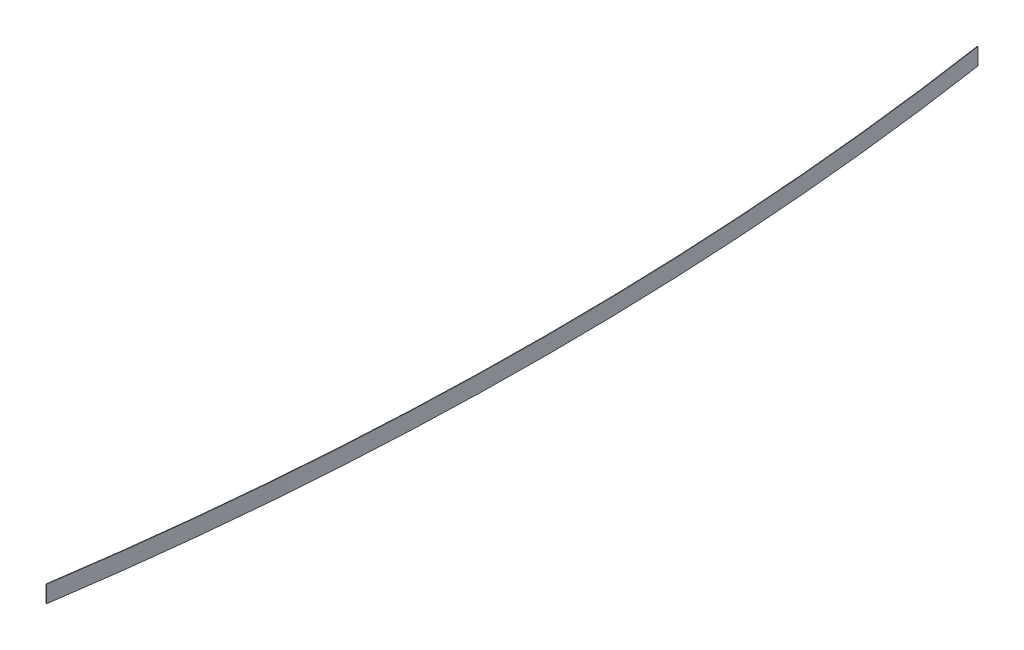
ISO-10303-21;
HEADER;
FILE_DESCRIPTION(('STEP AP214'),'2;1');
FILE_NAME('part.step','',(''),(''),'','','');
FILE_SCHEMA(('AUTOMOTIVE_DESIGN { 1 0 10303 214 1 1 1 1 }'));
ENDSEC;
DATA;
#1=APPLICATION_CONTEXT('core data for automotive mechanical design processes');
#2=APPLICATION_PROTOCOL_DEFINITION('international standard','automotive_design',2000,#1);
#3=PRODUCT_CONTEXT('',#1,'mechanical');
#4=PRODUCT('Part','Part','',(#3));
#5=PRODUCT_RELATED_PRODUCT_CATEGORY('part','',(#4));
#6=PRODUCT_DEFINITION_FORMATION('','',#4);
#7=PRODUCT_DEFINITION_CONTEXT('part definition',#1,'design');
#8=PRODUCT_DEFINITION('design','',#6,#7);
#9=PRODUCT_DEFINITION_SHAPE('','',#8);
#10=(LENGTH_UNIT() NAMED_UNIT(*) SI_UNIT(.MILLI.,.METRE.));
#11=(NAMED_UNIT(*) PLANE_ANGLE_UNIT() SI_UNIT($,.RADIAN.));
#12=(NAMED_UNIT(*) SI_UNIT($,.STERADIAN.) SOLID_ANGLE_UNIT());
#13=UNCERTAINTY_MEASURE_WITH_UNIT(LENGTH_MEASURE(1.E-05),#10,'distance_accuracy_value','');
#14=(GEOMETRIC_REPRESENTATION_CONTEXT(3) GLOBAL_UNCERTAINTY_ASSIGNED_CONTEXT((#13)) GLOBAL_UNIT_ASSIGNED_CONTEXT((#10,
#11,#12)) REPRESENTATION_CONTEXT('',''));
#15=CARTESIAN_POINT('',(0.,0.,0.));
#16=DIRECTION('',(0.,0.,1.));
#17=DIRECTION('',(1.,0.,0.));
#18=AXIS2_PLACEMENT_3D('',#15,#16,#17);
#19=CARTESIAN_POINT('',(-3.55271367880053E-12,56.9999999994,1.33226762955018E-12));
#20=DIRECTION('',(0.,1.,0.));
#21=DIRECTION('',(-1.,0.,0.));
#22=AXIS2_PLACEMENT_3D('',#19,#20,#21);
#23=PLANE('',#22);
#24=DIRECTION('',(0.988912431917555,0.,-0.148499838380073));
#25=VECTOR('',#24,1.);
#26=CARTESIAN_POINT('',(20830.9459221273,57.0000000000004,-3128.07484555705));
#27=LINE('',#26,#25);
#28=CARTESIAN_POINT('',(20829.4625534795,57.0000000000004,-3127.85209579947));
#29=VERTEX_POINT('',#28);
#30=CARTESIAN_POINT('',(20832.4292907752,57.0000000000005,-3128.29759531461));
#31=VERTEX_POINT('',#30);
#32=EDGE_CURVE('E11',#29,#31,#27,.T.);
#33=ORIENTED_EDGE('',*,*,#32,.F.);
#34=CARTESIAN_POINT('',(-3.55271367880053E-12,56.9999999994,1.33226762955018E-12));
#35=DIRECTION('',(0.,1.,0.));
#36=DIRECTION('',(-1.,0.,0.));
#37=AXIS2_PLACEMENT_3D('',#34,#35,#36);
#38=CIRCLE('',#37,21063.);
#39=CARTESIAN_POINT('',(20829.4625534795,57.000000000097,3127.85209579947));
#40=VERTEX_POINT('',#39);
#41=EDGE_CURVE('E103',#29,#40,#38,.F.);
#42=ORIENTED_EDGE('',*,*,#41,.T.);
#43=DIRECTION('',(0.988912431917555,0.,0.148499838380073));
#44=VECTOR('',#43,1.);
#45=CARTESIAN_POINT('',(20830.9459221273,57.0000000000976,3128.07484555704));
#46=LINE('',#45,#44);
#47=CARTESIAN_POINT('',(20832.4292907752,57.0000000000971,3128.29759531461));
#48=VERTEX_POINT('',#47);
#49=EDGE_CURVE('E51',#40,#48,#46,.T.);
#50=ORIENTED_EDGE('',*,*,#49,.T.);
#51=CARTESIAN_POINT('',(-3.55271367880053E-12,56.9999999994,1.33226762955018E-12));
#52=DIRECTION('',(0.,1.,0.));
#53=DIRECTION('',(-1.,0.,0.));
#54=AXIS2_PLACEMENT_3D('',#51,#52,#53);
#55=CIRCLE('',#54,21066.);
#56=EDGE_CURVE('E97',#31,#48,#55,.F.);
#57=ORIENTED_EDGE('',*,*,#56,.F.);
#58=EDGE_LOOP('',(#33,#42,#50,#57));
#59=FACE_BOUND('',#58,.T.);
#60=ADVANCED_FACE('F41',(#59),#23,.T.);
#61=CARTESIAN_POINT('',(20830.9459221273,9.73388036840106E-11,3128.07484555704));
#62=DIRECTION('',(-0.148499838380073,0.,0.988912431917555));
#63=DIRECTION('',(0.,-1.,0.));
#64=AXIS2_PLACEMENT_3D('',#61,#62,#63);
#65=PLANE('',#64);
#66=ORIENTED_EDGE('',*,*,#49,.F.);
#67=DIRECTION('',(0.,1.,0.));
#68=VECTOR('',#67,1.);
#69=CARTESIAN_POINT('',(20829.4625534797,-6338.29091595613,3127.85209579957));
#70=LINE('',#69,#68);
#71=CARTESIAN_POINT('',(20829.4625534795,-56.9999999999029,3127.85209579947));
#72=VERTEX_POINT('',#71);
#73=EDGE_CURVE('E85',#40,#72,#70,.F.);
#74=ORIENTED_EDGE('',*,*,#73,.T.);
#75=DIRECTION('',(0.988912431917555,0.,0.148499838380073));
#76=VECTOR('',#75,1.);
#77=CARTESIAN_POINT('',(20830.9459221273,-56.9999999999029,3128.07484555704));
#78=LINE('',#77,#76);
#79=CARTESIAN_POINT('',(20832.4292907752,-56.9999999999028,3128.29759531462));
#80=VERTEX_POINT('',#79);
#81=EDGE_CURVE('E80',#72,#80,#78,.T.);
#82=ORIENTED_EDGE('',*,*,#81,.T.);
#83=DIRECTION('',(0.,1.,0.));
#84=VECTOR('',#83,1.);
#85=CARTESIAN_POINT('',(20832.4292907754,-6338.29091595613,3128.29759531471));
#86=LINE('',#85,#84);
#87=EDGE_CURVE('E83',#48,#80,#86,.F.);
#88=ORIENTED_EDGE('',*,*,#87,.F.);
#89=EDGE_LOOP('',(#66,#74,#82,#88));
#90=FACE_BOUND('',#89,.T.);
#91=ADVANCED_FACE('F82',(#90),#65,.T.);
#92=CARTESIAN_POINT('',(0.,-57.0000000006008,3.10862446895043E-12));
#93=DIRECTION('',(0.,-1.,0.));
#94=DIRECTION('',(1.,0.,0.));
#95=AXIS2_PLACEMENT_3D('',#92,#93,#94);
#96=PLANE('',#95);
#97=ORIENTED_EDGE('',*,*,#81,.F.);
#98=CARTESIAN_POINT('',(0.,-57.0000000006008,3.10862446895043E-12));
#99=DIRECTION('',(0.,1.,0.));
#100=DIRECTION('',(-1.,0.,0.));
#101=AXIS2_PLACEMENT_3D('',#98,#99,#100);
#102=CIRCLE('',#101,21063.);
#103=CARTESIAN_POINT('',(20829.4625534795,-57.0000000000004,-3127.85209579944));
#104=VERTEX_POINT('',#103);
#105=EDGE_CURVE('E109',#72,#104,#102,.T.);
#106=ORIENTED_EDGE('',*,*,#105,.T.);
#107=DIRECTION('',(0.988912431917555,0.,-0.148499838380072));
#108=VECTOR('',#107,1.);
#109=CARTESIAN_POINT('',(20830.9459221273,-57.0000000000004,-3128.07484555702));
#110=LINE('',#109,#108);
#111=CARTESIAN_POINT('',(20832.4292907752,-57.0000000000003,-3128.29759531459));
#112=VERTEX_POINT('',#111);
#113=EDGE_CURVE('E45',#104,#112,#110,.T.);
#114=ORIENTED_EDGE('',*,*,#113,.T.);
#115=CARTESIAN_POINT('',(0.,-57.0000000006008,3.10862446895043E-12));
#116=DIRECTION('',(0.,1.,0.));
#117=DIRECTION('',(-1.,0.,0.));
#118=AXIS2_PLACEMENT_3D('',#115,#116,#117);
#119=CIRCLE('',#118,21066.);
#120=EDGE_CURVE('E96',#80,#112,#119,.T.);
#121=ORIENTED_EDGE('',*,*,#120,.F.);
#122=EDGE_LOOP('',(#97,#106,#114,#121));
#123=FACE_BOUND('',#122,.T.);
#124=ADVANCED_FACE('F99',(#123),#96,.T.);
#125=CARTESIAN_POINT('',(20830.9459221273,0.,-3128.07484555704));
#126=DIRECTION('',(-0.148499838380073,0.,-0.988912431917555));
#127=DIRECTION('',(0.,1.,0.));
#128=AXIS2_PLACEMENT_3D('',#125,#126,#127);
#129=PLANE('',#128);
#130=DIRECTION('',(0.,1.,0.));
#131=VECTOR('',#130,1.);
#132=CARTESIAN_POINT('',(20829.4625534797,-6338.29091595623,-3127.85209579937));
#133=LINE('',#132,#131);
#134=EDGE_CURVE('E101',#104,#29,#133,.T.);
#135=ORIENTED_EDGE('',*,*,#134,.T.);
#136=ORIENTED_EDGE('',*,*,#32,.T.);
#137=DIRECTION('',(0.,1.,0.));
#138=VECTOR('',#137,1.);
#139=CARTESIAN_POINT('',(20832.4292907754,-6338.29091595623,-3128.29759531451));
#140=LINE('',#139,#138);
#141=EDGE_CURVE('E107',#112,#31,#140,.T.);
#142=ORIENTED_EDGE('',*,*,#141,.F.);
#143=ORIENTED_EDGE('',*,*,#113,.F.);
#144=EDGE_LOOP('',(#135,#136,#142,#143));
#145=FACE_BOUND('',#144,.T.);
#146=ADVANCED_FACE('F43',(#145),#129,.T.);
#147=CARTESIAN_POINT('',(1.95751124189851E-10,-6338.29091595683,1.00984186563876E-10));
#148=DIRECTION('',(0.,1.,0.));
#149=DIRECTION('',(-1.,0.,0.));
#150=AXIS2_PLACEMENT_3D('',#147,#148,#149);
#151=CYLINDRICAL_SURFACE('',#150,21066.);
#152=ORIENTED_EDGE('',*,*,#120,.T.);
#153=ORIENTED_EDGE('',*,*,#141,.T.);
#154=ORIENTED_EDGE('',*,*,#56,.T.);
#155=ORIENTED_EDGE('',*,*,#87,.T.);
#156=EDGE_LOOP('',(#152,#153,#154,#155));
#157=FACE_BOUND('',#156,.T.);
#158=ADVANCED_FACE('F94',(#157),#151,.T.);
#159=CARTESIAN_POINT('',(1.95751124189851E-10,-6338.29091595683,1.00984186563876E-10));
#160=DIRECTION('',(0.,1.,0.));
#161=DIRECTION('',(-1.,0.,0.));
#162=AXIS2_PLACEMENT_3D('',#159,#160,#161);
#163=CYLINDRICAL_SURFACE('',#162,21063.);
#164=ORIENTED_EDGE('',*,*,#105,.F.);
#165=ORIENTED_EDGE('',*,*,#73,.F.);
#166=ORIENTED_EDGE('',*,*,#41,.F.);
#167=ORIENTED_EDGE('',*,*,#134,.F.);
#168=EDGE_LOOP('',(#164,#165,#166,#167));
#169=FACE_BOUND('',#168,.T.);
#170=ADVANCED_FACE('F114',(#169),#163,.F.);
#171=CLOSED_SHELL('',(#60,#91,#124,#146,#158,#170));
#172=MANIFOLD_SOLID_BREP('B2',#171);
#173=ADVANCED_BREP_SHAPE_REPRESENTATION('',(#18,#172),#14);
#174=SHAPE_DEFINITION_REPRESENTATION(#9,#173);
ENDSEC;
END-ISO-10303-21;
